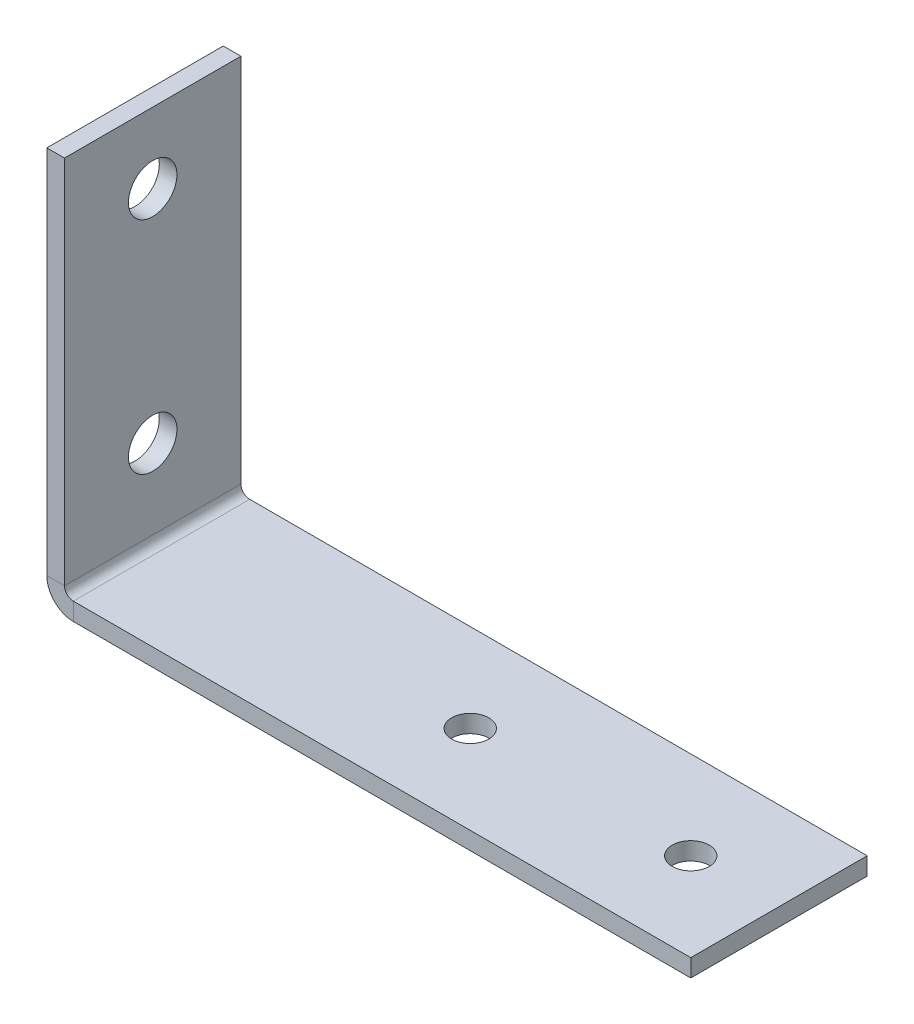
ISO-10303-21;
HEADER;
FILE_DESCRIPTION(('STEP AP214'),'2;1');
FILE_NAME('part.step','',(''),(''),'','','');
FILE_SCHEMA(('AUTOMOTIVE_DESIGN { 1 0 10303 214 1 1 1 1 }'));
ENDSEC;
DATA;
#1=APPLICATION_CONTEXT('core data for automotive mechanical design processes');
#2=APPLICATION_PROTOCOL_DEFINITION('international standard','automotive_design',2000,#1);
#3=PRODUCT_CONTEXT('',#1,'mechanical');
#4=PRODUCT('Part','Part','',(#3));
#5=PRODUCT_RELATED_PRODUCT_CATEGORY('part','',(#4));
#6=PRODUCT_DEFINITION_FORMATION('','',#4);
#7=PRODUCT_DEFINITION_CONTEXT('part definition',#1,'design');
#8=PRODUCT_DEFINITION('design','',#6,#7);
#9=PRODUCT_DEFINITION_SHAPE('','',#8);
#10=(LENGTH_UNIT() NAMED_UNIT(*) SI_UNIT(.MILLI.,.METRE.));
#11=(NAMED_UNIT(*) PLANE_ANGLE_UNIT() SI_UNIT($,.RADIAN.));
#12=(NAMED_UNIT(*) SI_UNIT($,.STERADIAN.) SOLID_ANGLE_UNIT());
#13=UNCERTAINTY_MEASURE_WITH_UNIT(LENGTH_MEASURE(1.E-05),#10,'distance_accuracy_value','');
#14=(GEOMETRIC_REPRESENTATION_CONTEXT(3) GLOBAL_UNCERTAINTY_ASSIGNED_CONTEXT((#13)) GLOBAL_UNIT_ASSIGNED_CONTEXT((#10,
#11,#12)) REPRESENTATION_CONTEXT('',''));
#15=CARTESIAN_POINT('',(0.,0.,0.));
#16=DIRECTION('',(0.,0.,1.));
#17=DIRECTION('',(1.,0.,0.));
#18=AXIS2_PLACEMENT_3D('',#15,#16,#17);
#19=CARTESIAN_POINT('',(-35.,-2.,-20.));
#20=DIRECTION('',(0.,0.,-1.));
#21=DIRECTION('',(-1.,0.,0.));
#22=AXIS2_PLACEMENT_3D('',#19,#20,#21);
#23=PLANE('',#22);
#24=DIRECTION('',(-1.,0.,0.));
#25=VECTOR('',#24,1.);
#26=CARTESIAN_POINT('',(-35.,0.,-20.));
#27=LINE('',#26,#25);
#28=CARTESIAN_POINT('',(35.,0.,-20.));
#29=VERTEX_POINT('',#28);
#30=CARTESIAN_POINT('',(-35.,0.,-20.));
#31=VERTEX_POINT('',#30);
#32=EDGE_CURVE('E189',#29,#31,#27,.T.);
#33=ORIENTED_EDGE('',*,*,#32,.F.);
#34=DIRECTION('',(0.,1.,0.));
#35=VECTOR('',#34,1.);
#36=CARTESIAN_POINT('',(35.,-2.,-20.));
#37=LINE('',#36,#35);
#38=CARTESIAN_POINT('',(35.,-2.,-20.));
#39=VERTEX_POINT('',#38);
#40=EDGE_CURVE('E69',#39,#29,#37,.T.);
#41=ORIENTED_EDGE('',*,*,#40,.F.);
#42=DIRECTION('',(-1.,0.,0.));
#43=VECTOR('',#42,1.);
#44=CARTESIAN_POINT('',(-35.,-2.,-20.));
#45=LINE('',#44,#43);
#46=CARTESIAN_POINT('',(-35.,-2.,-20.));
#47=VERTEX_POINT('',#46);
#48=EDGE_CURVE('E194',#39,#47,#45,.T.);
#49=ORIENTED_EDGE('',*,*,#48,.T.);
#50=DIRECTION('',(0.,1.,0.));
#51=VECTOR('',#50,1.);
#52=CARTESIAN_POINT('',(-35.,-2.,-20.));
#53=LINE('',#52,#51);
#54=EDGE_CURVE('E13',#47,#31,#53,.T.);
#55=ORIENTED_EDGE('',*,*,#54,.T.);
#56=EDGE_LOOP('',(#33,#41,#49,#55));
#57=FACE_BOUND('',#56,.T.);
#58=ADVANCED_FACE('F59',(#57),#23,.T.);
#59=CARTESIAN_POINT('',(35.,-2.,-20.));
#60=DIRECTION('',(1.,0.,0.));
#61=DIRECTION('',(0.,0.,-1.));
#62=AXIS2_PLACEMENT_3D('',#59,#60,#61);
#63=PLANE('',#62);
#64=DIRECTION('',(0.,0.,-1.));
#65=VECTOR('',#64,1.);
#66=CARTESIAN_POINT('',(35.,0.,-20.));
#67=LINE('',#66,#65);
#68=CARTESIAN_POINT('',(35.,0.,0.));
#69=VERTEX_POINT('',#68);
#70=EDGE_CURVE('E201',#69,#29,#67,.T.);
#71=ORIENTED_EDGE('',*,*,#70,.F.);
#72=DIRECTION('',(0.,1.,0.));
#73=VECTOR('',#72,1.);
#74=CARTESIAN_POINT('',(35.,-2.,0.));
#75=LINE('',#74,#73);
#76=CARTESIAN_POINT('',(35.,-2.,0.));
#77=VERTEX_POINT('',#76);
#78=EDGE_CURVE('E102',#77,#69,#75,.T.);
#79=ORIENTED_EDGE('',*,*,#78,.F.);
#80=DIRECTION('',(0.,0.,-1.));
#81=VECTOR('',#80,1.);
#82=CARTESIAN_POINT('',(35.,-2.,-20.));
#83=LINE('',#82,#81);
#84=EDGE_CURVE('E192',#77,#39,#83,.T.);
#85=ORIENTED_EDGE('',*,*,#84,.T.);
#86=ORIENTED_EDGE('',*,*,#40,.T.);
#87=EDGE_LOOP('',(#71,#79,#85,#86));
#88=FACE_BOUND('',#87,.T.);
#89=ADVANCED_FACE('F258',(#88),#63,.T.);
#90=CARTESIAN_POINT('',(-35.,-2.,0.));
#91=DIRECTION('',(0.,0.,1.));
#92=DIRECTION('',(1.,0.,0.));
#93=AXIS2_PLACEMENT_3D('',#90,#91,#92);
#94=PLANE('',#93);
#95=DIRECTION('',(1.,0.,0.));
#96=VECTOR('',#95,1.);
#97=CARTESIAN_POINT('',(-35.,0.,0.));
#98=LINE('',#97,#96);
#99=CARTESIAN_POINT('',(-35.,0.,0.));
#100=VERTEX_POINT('',#99);
#101=EDGE_CURVE('E198',#100,#69,#98,.T.);
#102=ORIENTED_EDGE('',*,*,#101,.F.);
#103=DIRECTION('',(0.,1.,0.));
#104=VECTOR('',#103,1.);
#105=CARTESIAN_POINT('',(-35.,-2.,0.));
#106=LINE('',#105,#104);
#107=CARTESIAN_POINT('',(-35.,-2.,0.));
#108=VERTEX_POINT('',#107);
#109=EDGE_CURVE('E63',#108,#100,#106,.T.);
#110=ORIENTED_EDGE('',*,*,#109,.F.);
#111=DIRECTION('',(1.,0.,0.));
#112=VECTOR('',#111,1.);
#113=CARTESIAN_POINT('',(-35.,-2.,0.));
#114=LINE('',#113,#112);
#115=EDGE_CURVE('E188',#108,#77,#114,.T.);
#116=ORIENTED_EDGE('',*,*,#115,.T.);
#117=ORIENTED_EDGE('',*,*,#78,.T.);
#118=EDGE_LOOP('',(#102,#110,#116,#117));
#119=FACE_BOUND('',#118,.T.);
#120=ADVANCED_FACE('F61',(#119),#94,.T.);
#121=CARTESIAN_POINT('',(0.,-2.,0.));
#122=DIRECTION('',(0.,1.,0.));
#123=DIRECTION('',(0.,0.,1.));
#124=AXIS2_PLACEMENT_3D('',#121,#122,#123);
#125=PLANE('',#124);
#126=CARTESIAN_POINT('',(0.,-2.,-10.));
#127=DIRECTION('',(0.,1.,0.));
#128=DIRECTION('',(0.,0.,1.));
#129=AXIS2_PLACEMENT_3D('',#126,#127,#128);
#130=CIRCLE('',#129,2.1);
#131=CARTESIAN_POINT('',(0.,-2.,-7.9));
#132=VERTEX_POINT('',#131);
#133=EDGE_CURVE('E240',#132,#132,#130,.T.);
#134=ORIENTED_EDGE('',*,*,#133,.T.);
#135=EDGE_LOOP('',(#134));
#136=FACE_BOUND('',#135,.T.);
#137=CARTESIAN_POINT('',(25.,-2.,-10.));
#138=DIRECTION('',(0.,1.,0.));
#139=DIRECTION('',(0.,0.,1.));
#140=AXIS2_PLACEMENT_3D('',#137,#138,#139);
#141=CIRCLE('',#140,2.1);
#142=CARTESIAN_POINT('',(25.,-2.,-7.9));
#143=VERTEX_POINT('',#142);
#144=EDGE_CURVE('E234',#143,#143,#141,.T.);
#145=ORIENTED_EDGE('',*,*,#144,.T.);
#146=EDGE_LOOP('',(#145));
#147=FACE_BOUND('',#146,.T.);
#148=DIRECTION('',(0.,0.,1.));
#149=VECTOR('',#148,1.);
#150=CARTESIAN_POINT('',(-35.,-2.,-20.));
#151=LINE('',#150,#149);
#152=EDGE_CURVE('E78',#47,#108,#151,.T.);
#153=ORIENTED_EDGE('',*,*,#152,.F.);
#154=ORIENTED_EDGE('',*,*,#48,.F.);
#155=ORIENTED_EDGE('',*,*,#84,.F.);
#156=ORIENTED_EDGE('',*,*,#115,.F.);
#157=EDGE_LOOP('',(#153,#154,#155,#156));
#158=FACE_BOUND('',#157,.T.);
#159=ADVANCED_FACE('F254',(#136,#147,#158),#125,.F.);
#160=CARTESIAN_POINT('',(0.,0.,0.));
#161=DIRECTION('',(0.,1.,0.));
#162=DIRECTION('',(0.,0.,1.));
#163=AXIS2_PLACEMENT_3D('',#160,#161,#162);
#164=PLANE('',#163);
#165=CARTESIAN_POINT('',(0.,0.,-10.));
#166=DIRECTION('',(0.,1.,0.));
#167=DIRECTION('',(0.,0.,1.));
#168=AXIS2_PLACEMENT_3D('',#165,#166,#167);
#169=CIRCLE('',#168,2.1);
#170=CARTESIAN_POINT('',(0.,0.,-7.9));
#171=VERTEX_POINT('',#170);
#172=EDGE_CURVE('E243',#171,#171,#169,.T.);
#173=ORIENTED_EDGE('',*,*,#172,.F.);
#174=EDGE_LOOP('',(#173));
#175=FACE_BOUND('',#174,.T.);
#176=CARTESIAN_POINT('',(25.,0.,-10.));
#177=DIRECTION('',(0.,1.,0.));
#178=DIRECTION('',(0.,0.,1.));
#179=AXIS2_PLACEMENT_3D('',#176,#177,#178);
#180=CIRCLE('',#179,2.1);
#181=CARTESIAN_POINT('',(25.,0.,-7.9));
#182=VERTEX_POINT('',#181);
#183=EDGE_CURVE('E237',#182,#182,#180,.T.);
#184=ORIENTED_EDGE('',*,*,#183,.F.);
#185=EDGE_LOOP('',(#184));
#186=FACE_BOUND('',#185,.T.);
#187=DIRECTION('',(0.,0.,1.));
#188=VECTOR('',#187,1.);
#189=CARTESIAN_POINT('',(-35.,0.,-20.));
#190=LINE('',#189,#188);
#191=EDGE_CURVE('E177',#31,#100,#190,.T.);
#192=ORIENTED_EDGE('',*,*,#191,.T.);
#193=ORIENTED_EDGE('',*,*,#101,.T.);
#194=ORIENTED_EDGE('',*,*,#70,.T.);
#195=ORIENTED_EDGE('',*,*,#32,.T.);
#196=EDGE_LOOP('',(#192,#193,#194,#195));
#197=FACE_BOUND('',#196,.T.);
#198=ADVANCED_FACE('F250',(#175,#186,#197),#164,.T.);
#199=CARTESIAN_POINT('',(-35.,0.999999999999997,-20.));
#200=DIRECTION('',(0.,0.,-1.));
#201=DIRECTION('',(-1.,0.,0.));
#202=AXIS2_PLACEMENT_3D('',#199,#200,#201);
#203=PLANE('',#202);
#204=DIRECTION('',(1.,0.,0.));
#205=VECTOR('',#204,1.);
#206=CARTESIAN_POINT('',(-38.,0.999999999999987,-20.));
#207=LINE('',#206,#205);
#208=CARTESIAN_POINT('',(-36.,0.999999999999994,-20.));
#209=VERTEX_POINT('',#208);
#210=CARTESIAN_POINT('',(-38.,0.999999999999987,-20.));
#211=VERTEX_POINT('',#210);
#212=EDGE_CURVE('E156',#209,#211,#207,.F.);
#213=ORIENTED_EDGE('',*,*,#212,.F.);
#214=CARTESIAN_POINT('',(-35.,0.999999999999997,-20.));
#215=DIRECTION('',(0.,0.,1.));
#216=DIRECTION('',(1.,0.,0.));
#217=AXIS2_PLACEMENT_3D('',#214,#215,#216);
#218=CIRCLE('',#217,1.);
#219=EDGE_CURVE('E181',#31,#209,#218,.F.);
#220=ORIENTED_EDGE('',*,*,#219,.F.);
#221=ORIENTED_EDGE('',*,*,#54,.F.);
#222=CARTESIAN_POINT('',(-35.,0.999999999999997,-20.));
#223=DIRECTION('',(0.,0.,1.));
#224=DIRECTION('',(1.,0.,0.));
#225=AXIS2_PLACEMENT_3D('',#222,#223,#224);
#226=CIRCLE('',#225,3.);
#227=EDGE_CURVE('E174',#47,#211,#226,.F.);
#228=ORIENTED_EDGE('',*,*,#227,.T.);
#229=EDGE_LOOP('',(#213,#220,#221,#228));
#230=FACE_BOUND('',#229,.T.);
#231=ADVANCED_FACE('F253',(#230),#203,.T.);
#232=CARTESIAN_POINT('',(-35.,0.999999999999997,0.));
#233=DIRECTION('',(0.,0.,-1.));
#234=DIRECTION('',(-1.,0.,0.));
#235=AXIS2_PLACEMENT_3D('',#232,#233,#234);
#236=PLANE('',#235);
#237=CARTESIAN_POINT('',(-35.,0.999999999999997,0.));
#238=DIRECTION('',(0.,0.,1.));
#239=DIRECTION('',(1.,0.,0.));
#240=AXIS2_PLACEMENT_3D('',#237,#238,#239);
#241=CIRCLE('',#240,1.);
#242=CARTESIAN_POINT('',(-36.,0.999999999999994,0.));
#243=VERTEX_POINT('',#242);
#244=EDGE_CURVE('E184',#243,#100,#241,.T.);
#245=ORIENTED_EDGE('',*,*,#244,.F.);
#246=DIRECTION('',(1.,0.,0.));
#247=VECTOR('',#246,1.);
#248=CARTESIAN_POINT('',(-36.,0.999999999999994,0.));
#249=LINE('',#248,#247);
#250=CARTESIAN_POINT('',(-38.,0.999999999999987,0.));
#251=VERTEX_POINT('',#250);
#252=EDGE_CURVE('E167',#243,#251,#249,.F.);
#253=ORIENTED_EDGE('',*,*,#252,.T.);
#254=CARTESIAN_POINT('',(-35.,0.999999999999997,0.));
#255=DIRECTION('',(0.,0.,1.));
#256=DIRECTION('',(1.,0.,0.));
#257=AXIS2_PLACEMENT_3D('',#254,#255,#256);
#258=CIRCLE('',#257,3.);
#259=EDGE_CURVE('E178',#251,#108,#258,.T.);
#260=ORIENTED_EDGE('',*,*,#259,.T.);
#261=ORIENTED_EDGE('',*,*,#109,.T.);
#262=EDGE_LOOP('',(#245,#253,#260,#261));
#263=FACE_BOUND('',#262,.T.);
#264=ADVANCED_FACE('F209',(#263),#236,.F.);
#265=CARTESIAN_POINT('',(-35.,0.999999999999997,0.));
#266=DIRECTION('',(0.,0.,1.));
#267=DIRECTION('',(-1.,0.,0.));
#268=AXIS2_PLACEMENT_3D('',#265,#266,#267);
#269=CYLINDRICAL_SURFACE('',#268,3.);
#270=ORIENTED_EDGE('',*,*,#152,.T.);
#271=ORIENTED_EDGE('',*,*,#259,.F.);
#272=DIRECTION('',(0.,0.,1.));
#273=VECTOR('',#272,1.);
#274=CARTESIAN_POINT('',(-38.,0.999999999999987,-20.));
#275=LINE('',#274,#273);
#276=EDGE_CURVE('E165',#251,#211,#275,.F.);
#277=ORIENTED_EDGE('',*,*,#276,.T.);
#278=ORIENTED_EDGE('',*,*,#227,.F.);
#279=EDGE_LOOP('',(#270,#271,#277,#278));
#280=FACE_BOUND('',#279,.T.);
#281=ADVANCED_FACE('F302',(#280),#269,.T.);
#282=CARTESIAN_POINT('',(-35.,0.999999999999997,0.));
#283=DIRECTION('',(0.,0.,1.));
#284=DIRECTION('',(-1.,0.,0.));
#285=AXIS2_PLACEMENT_3D('',#282,#283,#284);
#286=CYLINDRICAL_SURFACE('',#285,1.);
#287=ORIENTED_EDGE('',*,*,#191,.F.);
#288=ORIENTED_EDGE('',*,*,#219,.T.);
#289=DIRECTION('',(0.,0.,1.));
#290=VECTOR('',#289,1.);
#291=CARTESIAN_POINT('',(-36.,0.999999999999994,-20.));
#292=LINE('',#291,#290);
#293=EDGE_CURVE('E170',#209,#243,#292,.T.);
#294=ORIENTED_EDGE('',*,*,#293,.T.);
#295=ORIENTED_EDGE('',*,*,#244,.T.);
#296=EDGE_LOOP('',(#287,#288,#294,#295));
#297=FACE_BOUND('',#296,.T.);
#298=ADVANCED_FACE('F213',(#297),#286,.F.);
#299=CARTESIAN_POINT('',(-38.,0.,-20.));
#300=DIRECTION('',(0.,0.,1.));
#301=DIRECTION('',(0.,-1.,0.));
#302=AXIS2_PLACEMENT_3D('',#299,#300,#301);
#303=PLANE('',#302);
#304=ORIENTED_EDGE('',*,*,#212,.T.);
#305=DIRECTION('',(0.,-1.,0.));
#306=VECTOR('',#305,1.);
#307=CARTESIAN_POINT('',(-38.,-1.23169093161714E-13,-20.));
#308=LINE('',#307,#306);
#309=CARTESIAN_POINT('',(-38.0000000000001,43.,-20.));
#310=VERTEX_POINT('',#309);
#311=EDGE_CURVE('E137',#310,#211,#308,.T.);
#312=ORIENTED_EDGE('',*,*,#311,.F.);
#313=DIRECTION('',(1.,0.,0.));
#314=VECTOR('',#313,1.);
#315=CARTESIAN_POINT('',(-38.0000000000001,43.,-20.));
#316=LINE('',#315,#314);
#317=CARTESIAN_POINT('',(-36.0000000000001,43.,-20.));
#318=VERTEX_POINT('',#317);
#319=EDGE_CURVE('E143',#310,#318,#316,.T.);
#320=ORIENTED_EDGE('',*,*,#319,.T.);
#321=DIRECTION('',(0.,1.,0.));
#322=VECTOR('',#321,1.);
#323=CARTESIAN_POINT('',(-36.,0.,-20.));
#324=LINE('',#323,#322);
#325=EDGE_CURVE('E163',#318,#209,#324,.F.);
#326=ORIENTED_EDGE('',*,*,#325,.T.);
#327=EDGE_LOOP('',(#304,#312,#320,#326));
#328=FACE_BOUND('',#327,.T.);
#329=ADVANCED_FACE('F155',(#328),#303,.F.);
#330=CARTESIAN_POINT('',(-38.0000000000001,43.,0.));
#331=DIRECTION('',(0.,0.,-1.));
#332=DIRECTION('',(0.,1.,0.));
#333=AXIS2_PLACEMENT_3D('',#330,#331,#332);
#334=PLANE('',#333);
#335=ORIENTED_EDGE('',*,*,#252,.F.);
#336=DIRECTION('',(0.,-1.,0.));
#337=VECTOR('',#336,1.);
#338=CARTESIAN_POINT('',(-36.0000000000001,43.,0.));
#339=LINE('',#338,#337);
#340=CARTESIAN_POINT('',(-36.0000000000001,43.,0.));
#341=VERTEX_POINT('',#340);
#342=EDGE_CURVE('E159',#243,#341,#339,.F.);
#343=ORIENTED_EDGE('',*,*,#342,.T.);
#344=DIRECTION('',(1.,0.,0.));
#345=VECTOR('',#344,1.);
#346=CARTESIAN_POINT('',(-38.0000000000001,43.,0.));
#347=LINE('',#346,#345);
#348=CARTESIAN_POINT('',(-38.0000000000001,43.,0.));
#349=VERTEX_POINT('',#348);
#350=EDGE_CURVE('E152',#349,#341,#347,.T.);
#351=ORIENTED_EDGE('',*,*,#350,.F.);
#352=DIRECTION('',(0.,1.,0.));
#353=VECTOR('',#352,1.);
#354=CARTESIAN_POINT('',(-38.,-1.31237574445327E-13,0.));
#355=LINE('',#354,#353);
#356=EDGE_CURVE('E139',#251,#349,#355,.T.);
#357=ORIENTED_EDGE('',*,*,#356,.F.);
#358=EDGE_LOOP('',(#335,#343,#351,#357));
#359=FACE_BOUND('',#358,.T.);
#360=ADVANCED_FACE('F220',(#359),#334,.F.);
#361=CARTESIAN_POINT('',(-38.,-1.31237574445327E-13,0.));
#362=DIRECTION('',(1.,0.,0.));
#363=DIRECTION('',(0.,1.,0.));
#364=AXIS2_PLACEMENT_3D('',#361,#362,#363);
#365=PLANE('',#364);
#366=CARTESIAN_POINT('',(-38.0000000000001,35.,-10.));
#367=DIRECTION('',(1.,0.,0.));
#368=DIRECTION('',(0.,1.,0.));
#369=AXIS2_PLACEMENT_3D('',#366,#367,#368);
#370=CIRCLE('',#369,2.74999999999999);
#371=CARTESIAN_POINT('',(-38.0000000000001,37.75,-10.));
#372=VERTEX_POINT('',#371);
#373=EDGE_CURVE('E228',#372,#372,#370,.T.);
#374=ORIENTED_EDGE('',*,*,#373,.T.);
#375=EDGE_LOOP('',(#374));
#376=FACE_BOUND('',#375,.T.);
#377=CARTESIAN_POINT('',(-38.,10.,-10.));
#378=DIRECTION('',(1.,0.,0.));
#379=DIRECTION('',(0.,1.,0.));
#380=AXIS2_PLACEMENT_3D('',#377,#378,#379);
#381=CIRCLE('',#380,2.74999999999999);
#382=CARTESIAN_POINT('',(-38.,12.75,-10.));
#383=VERTEX_POINT('',#382);
#384=EDGE_CURVE('E173',#383,#383,#381,.T.);
#385=ORIENTED_EDGE('',*,*,#384,.T.);
#386=EDGE_LOOP('',(#385));
#387=FACE_BOUND('',#386,.T.);
#388=ORIENTED_EDGE('',*,*,#276,.F.);
#389=ORIENTED_EDGE('',*,*,#356,.T.);
#390=DIRECTION('',(0.,0.,-1.));
#391=VECTOR('',#390,1.);
#392=CARTESIAN_POINT('',(-38.0000000000001,43.,0.));
#393=LINE('',#392,#391);
#394=EDGE_CURVE('E132',#349,#310,#393,.T.);
#395=ORIENTED_EDGE('',*,*,#394,.T.);
#396=ORIENTED_EDGE('',*,*,#311,.T.);
#397=EDGE_LOOP('',(#388,#389,#395,#396));
#398=FACE_BOUND('',#397,.T.);
#399=ADVANCED_FACE('F135',(#376,#387,#398),#365,.F.);
#400=CARTESIAN_POINT('',(-36.,-1.24254611767641E-13,0.));
#401=DIRECTION('',(1.,0.,0.));
#402=DIRECTION('',(0.,1.,0.));
#403=AXIS2_PLACEMENT_3D('',#400,#401,#402);
#404=PLANE('',#403);
#405=CARTESIAN_POINT('',(-36.,35.,-10.));
#406=DIRECTION('',(1.,0.,0.));
#407=DIRECTION('',(0.,0.,-1.));
#408=AXIS2_PLACEMENT_3D('',#405,#406,#407);
#409=CIRCLE('',#408,2.74999999999999);
#410=CARTESIAN_POINT('',(-36.,35.,-12.75));
#411=VERTEX_POINT('',#410);
#412=EDGE_CURVE('E231',#411,#411,#409,.T.);
#413=ORIENTED_EDGE('',*,*,#412,.F.);
#414=EDGE_LOOP('',(#413));
#415=FACE_BOUND('',#414,.T.);
#416=CARTESIAN_POINT('',(-36.,10.,-10.));
#417=DIRECTION('',(1.,0.,0.));
#418=DIRECTION('',(0.,0.,-1.));
#419=AXIS2_PLACEMENT_3D('',#416,#417,#418);
#420=CIRCLE('',#419,2.74999999999999);
#421=CARTESIAN_POINT('',(-36.,10.,-12.75));
#422=VERTEX_POINT('',#421);
#423=EDGE_CURVE('E225',#422,#422,#420,.T.);
#424=ORIENTED_EDGE('',*,*,#423,.F.);
#425=EDGE_LOOP('',(#424));
#426=FACE_BOUND('',#425,.T.);
#427=ORIENTED_EDGE('',*,*,#342,.F.);
#428=ORIENTED_EDGE('',*,*,#293,.F.);
#429=ORIENTED_EDGE('',*,*,#325,.F.);
#430=DIRECTION('',(0.,0.,1.));
#431=VECTOR('',#430,1.);
#432=CARTESIAN_POINT('',(-36.0000000000001,43.,-20.));
#433=LINE('',#432,#431);
#434=EDGE_CURVE('E148',#341,#318,#433,.F.);
#435=ORIENTED_EDGE('',*,*,#434,.F.);
#436=EDGE_LOOP('',(#427,#428,#429,#435));
#437=FACE_BOUND('',#436,.T.);
#438=ADVANCED_FACE('F218',(#415,#426,#437),#404,.T.);
#439=CARTESIAN_POINT('',(-38.0000000000001,43.,-20.));
#440=DIRECTION('',(0.,-1.,0.));
#441=DIRECTION('',(1.,0.,0.));
#442=AXIS2_PLACEMENT_3D('',#439,#440,#441);
#443=PLANE('',#442);
#444=ORIENTED_EDGE('',*,*,#434,.T.);
#445=ORIENTED_EDGE('',*,*,#319,.F.);
#446=ORIENTED_EDGE('',*,*,#394,.F.);
#447=ORIENTED_EDGE('',*,*,#350,.T.);
#448=EDGE_LOOP('',(#444,#445,#446,#447));
#449=FACE_BOUND('',#448,.T.);
#450=ADVANCED_FACE('F146',(#449),#443,.F.);
#451=CARTESIAN_POINT('',(-36.,10.,-10.));
#452=DIRECTION('',(1.,0.,0.));
#453=DIRECTION('',(0.,0.,-1.));
#454=AXIS2_PLACEMENT_3D('',#451,#452,#453);
#455=CYLINDRICAL_SURFACE('',#454,2.74999999999999);
#456=ORIENTED_EDGE('',*,*,#423,.T.);
#457=EDGE_LOOP('',(#456));
#458=FACE_BOUND('',#457,.T.);
#459=ORIENTED_EDGE('',*,*,#384,.F.);
#460=EDGE_LOOP('',(#459));
#461=FACE_BOUND('',#460,.T.);
#462=ADVANCED_FACE('F350',(#458,#461),#455,.F.);
#463=CARTESIAN_POINT('',(-36.,35.,-10.));
#464=DIRECTION('',(1.,0.,0.));
#465=DIRECTION('',(0.,0.,-1.));
#466=AXIS2_PLACEMENT_3D('',#463,#464,#465);
#467=CYLINDRICAL_SURFACE('',#466,2.74999999999999);
#468=ORIENTED_EDGE('',*,*,#412,.T.);
#469=EDGE_LOOP('',(#468));
#470=FACE_BOUND('',#469,.T.);
#471=ORIENTED_EDGE('',*,*,#373,.F.);
#472=EDGE_LOOP('',(#471));
#473=FACE_BOUND('',#472,.T.);
#474=ADVANCED_FACE('F378',(#470,#473),#467,.F.);
#475=CARTESIAN_POINT('',(25.,0.,-10.));
#476=DIRECTION('',(0.,1.,0.));
#477=DIRECTION('',(0.,0.,1.));
#478=AXIS2_PLACEMENT_3D('',#475,#476,#477);
#479=CYLINDRICAL_SURFACE('',#478,2.1);
#480=ORIENTED_EDGE('',*,*,#183,.T.);
#481=EDGE_LOOP('',(#480));
#482=FACE_BOUND('',#481,.T.);
#483=ORIENTED_EDGE('',*,*,#144,.F.);
#484=EDGE_LOOP('',(#483));
#485=FACE_BOUND('',#484,.T.);
#486=ADVANCED_FACE('F387',(#482,#485),#479,.F.);
#487=CARTESIAN_POINT('',(0.,0.,-10.));
#488=DIRECTION('',(0.,1.,0.));
#489=DIRECTION('',(0.,0.,1.));
#490=AXIS2_PLACEMENT_3D('',#487,#488,#489);
#491=CYLINDRICAL_SURFACE('',#490,2.1);
#492=ORIENTED_EDGE('',*,*,#172,.T.);
#493=EDGE_LOOP('',(#492));
#494=FACE_BOUND('',#493,.T.);
#495=ORIENTED_EDGE('',*,*,#133,.F.);
#496=EDGE_LOOP('',(#495));
#497=FACE_BOUND('',#496,.T.);
#498=ADVANCED_FACE('F247',(#494,#497),#491,.F.);
#499=CLOSED_SHELL('',(#58,#89,#120,#159,#198,#231,#264,#281,#298,#329,#360,#399,#438,#450,#462,
#474,#486,#498));
#500=MANIFOLD_SOLID_BREP('B2',#499);
#501=ADVANCED_BREP_SHAPE_REPRESENTATION('',(#18,#500),#14);
#502=SHAPE_DEFINITION_REPRESENTATION(#9,#501);
ENDSEC;
END-ISO-10303-21;
